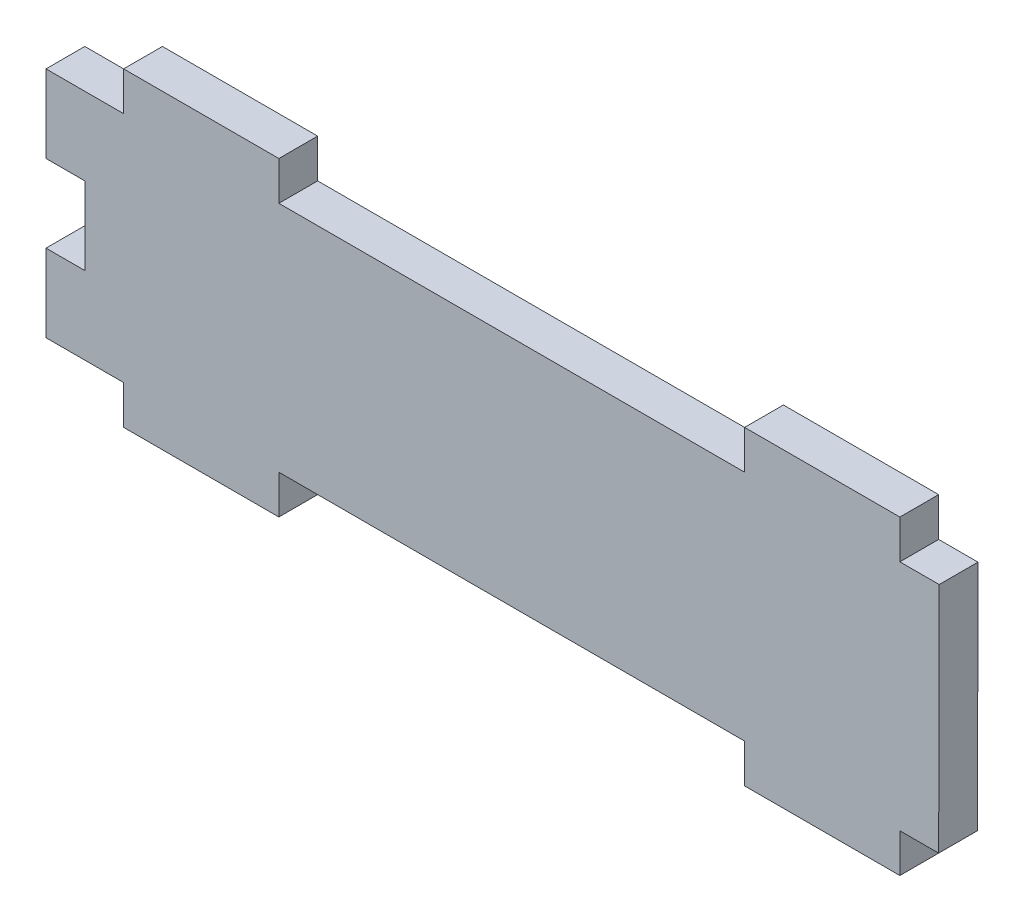
ISO-10303-21;
HEADER;
FILE_DESCRIPTION(('STEP AP214'),'2;1');
FILE_NAME('part.step','',(''),(''),'','','');
FILE_SCHEMA(('AUTOMOTIVE_DESIGN { 1 0 10303 214 1 1 1 1 }'));
ENDSEC;
DATA;
#1=APPLICATION_CONTEXT('core data for automotive mechanical design processes');
#2=APPLICATION_PROTOCOL_DEFINITION('international standard','automotive_design',2000,#1);
#3=PRODUCT_CONTEXT('',#1,'mechanical');
#4=PRODUCT('Part','Part','',(#3));
#5=PRODUCT_RELATED_PRODUCT_CATEGORY('part','',(#4));
#6=PRODUCT_DEFINITION_FORMATION('','',#4);
#7=PRODUCT_DEFINITION_CONTEXT('part definition',#1,'design');
#8=PRODUCT_DEFINITION('design','',#6,#7);
#9=PRODUCT_DEFINITION_SHAPE('','',#8);
#10=(LENGTH_UNIT() NAMED_UNIT(*) SI_UNIT(.MILLI.,.METRE.));
#11=(NAMED_UNIT(*) PLANE_ANGLE_UNIT() SI_UNIT($,.RADIAN.));
#12=(NAMED_UNIT(*) SI_UNIT($,.STERADIAN.) SOLID_ANGLE_UNIT());
#13=UNCERTAINTY_MEASURE_WITH_UNIT(LENGTH_MEASURE(1.E-05),#10,'distance_accuracy_value','');
#14=(GEOMETRIC_REPRESENTATION_CONTEXT(3) GLOBAL_UNCERTAINTY_ASSIGNED_CONTEXT((#13)) GLOBAL_UNIT_ASSIGNED_CONTEXT((#10,
#11,#12)) REPRESENTATION_CONTEXT('',''));
#15=CARTESIAN_POINT('',(0.,0.,0.));
#16=DIRECTION('',(0.,0.,1.));
#17=DIRECTION('',(1.,0.,0.));
#18=AXIS2_PLACEMENT_3D('',#15,#16,#17);
#19=CARTESIAN_POINT('',(146.134732735807,44.4499057789318,6.35));
#20=DIRECTION('',(-0.999997527006085,0.00222395632040106,0.));
#21=DIRECTION('',(-0.00222395632040106,-0.999997527006085,0.));
#22=AXIS2_PLACEMENT_3D('',#19,#20,#21);
#23=PLANE('',#22);
#24=DIRECTION('',(0.00222395632040106,0.999997527006085,0.));
#25=VECTOR('',#24,1.);
#26=CARTESIAN_POINT('',(146.134732735807,44.4499057789318,0.));
#27=LINE('',#26,#25);
#28=CARTESIAN_POINT('',(146.05,6.35,0.));
#29=VERTEX_POINT('',#28);
#30=CARTESIAN_POINT('',(146.134732735807,44.4499057789318,0.));
#31=VERTEX_POINT('',#30);
#32=EDGE_CURVE('E225',#29,#31,#27,.T.);
#33=ORIENTED_EDGE('',*,*,#32,.T.);
#34=DIRECTION('',(0.,0.,-1.));
#35=VECTOR('',#34,1.);
#36=CARTESIAN_POINT('',(146.134732735807,44.4499057789318,6.35));
#37=LINE('',#36,#35);
#38=CARTESIAN_POINT('',(146.134732735807,44.4499057789318,6.35));
#39=VERTEX_POINT('',#38);
#40=EDGE_CURVE('E11',#39,#31,#37,.T.);
#41=ORIENTED_EDGE('',*,*,#40,.F.);
#42=DIRECTION('',(0.00222395632040106,0.999997527006085,0.));
#43=VECTOR('',#42,1.);
#44=CARTESIAN_POINT('',(146.134732735807,44.4499057789318,6.35));
#45=LINE('',#44,#43);
#46=CARTESIAN_POINT('',(146.05,6.35,6.35));
#47=VERTEX_POINT('',#46);
#48=EDGE_CURVE('E273',#47,#39,#45,.T.);
#49=ORIENTED_EDGE('',*,*,#48,.F.);
#50=DIRECTION('',(0.,0.,-1.));
#51=VECTOR('',#50,1.);
#52=CARTESIAN_POINT('',(146.05,6.35,6.35));
#53=LINE('',#52,#51);
#54=EDGE_CURVE('E221',#47,#29,#53,.T.);
#55=ORIENTED_EDGE('',*,*,#54,.T.);
#56=EDGE_LOOP('',(#33,#41,#49,#55));
#57=FACE_BOUND('',#56,.T.);
#58=ADVANCED_FACE('F33',(#57),#23,.F.);
#59=CARTESIAN_POINT('',(139.70050083304,44.4499057789318,6.35));
#60=DIRECTION('',(0.,-1.,0.));
#61=DIRECTION('',(0.,0.,-1.));
#62=AXIS2_PLACEMENT_3D('',#59,#60,#61);
#63=PLANE('',#62);
#64=DIRECTION('',(-1.,0.,0.));
#65=VECTOR('',#64,1.);
#66=CARTESIAN_POINT('',(139.70050083304,44.4499057789318,0.));
#67=LINE('',#66,#65);
#68=CARTESIAN_POINT('',(139.70050083304,44.4499057789318,0.));
#69=VERTEX_POINT('',#68);
#70=EDGE_CURVE('E228',#31,#69,#67,.T.);
#71=ORIENTED_EDGE('',*,*,#70,.T.);
#72=DIRECTION('',(0.,0.,-1.));
#73=VECTOR('',#72,1.);
#74=CARTESIAN_POINT('',(139.70050083304,44.4499057789318,6.35));
#75=LINE('',#74,#73);
#76=CARTESIAN_POINT('',(139.70050083304,44.4499057789318,6.35));
#77=VERTEX_POINT('',#76);
#78=EDGE_CURVE('E41',#77,#69,#75,.T.);
#79=ORIENTED_EDGE('',*,*,#78,.F.);
#80=DIRECTION('',(-1.,0.,0.));
#81=VECTOR('',#80,1.);
#82=CARTESIAN_POINT('',(139.70050083304,44.4499057789318,6.35));
#83=LINE('',#82,#81);
#84=EDGE_CURVE('E140',#39,#77,#83,.T.);
#85=ORIENTED_EDGE('',*,*,#84,.F.);
#86=ORIENTED_EDGE('',*,*,#40,.T.);
#87=EDGE_LOOP('',(#71,#79,#85,#86));
#88=FACE_BOUND('',#87,.T.);
#89=ADVANCED_FACE('F411',(#88),#63,.F.);
#90=CARTESIAN_POINT('',(139.70050083304,44.4499057789318,6.35));
#91=DIRECTION('',(-1.,0.,0.));
#92=DIRECTION('',(0.,0.,1.));
#93=AXIS2_PLACEMENT_3D('',#90,#91,#92);
#94=PLANE('',#93);
#95=DIRECTION('',(0.,1.,0.));
#96=VECTOR('',#95,1.);
#97=CARTESIAN_POINT('',(139.70050083304,44.4499057789318,0.));
#98=LINE('',#97,#96);
#99=CARTESIAN_POINT('',(139.70050083304,50.8,0.));
#100=VERTEX_POINT('',#99);
#101=EDGE_CURVE('E230',#69,#100,#98,.T.);
#102=ORIENTED_EDGE('',*,*,#101,.T.);
#103=DIRECTION('',(0.,0.,-1.));
#104=VECTOR('',#103,1.);
#105=CARTESIAN_POINT('',(139.70050083304,50.8,6.35));
#106=LINE('',#105,#104);
#107=CARTESIAN_POINT('',(139.70050083304,50.8,6.35));
#108=VERTEX_POINT('',#107);
#109=EDGE_CURVE('E328',#108,#100,#106,.T.);
#110=ORIENTED_EDGE('',*,*,#109,.F.);
#111=DIRECTION('',(0.,1.,0.));
#112=VECTOR('',#111,1.);
#113=CARTESIAN_POINT('',(139.70050083304,44.4499057789318,6.35));
#114=LINE('',#113,#112);
#115=EDGE_CURVE('E336',#77,#108,#114,.T.);
#116=ORIENTED_EDGE('',*,*,#115,.F.);
#117=ORIENTED_EDGE('',*,*,#78,.T.);
#118=EDGE_LOOP('',(#102,#110,#116,#117));
#119=FACE_BOUND('',#118,.T.);
#120=ADVANCED_FACE('F334',(#119),#94,.F.);
#121=CARTESIAN_POINT('',(114.3,50.8,6.35));
#122=DIRECTION('',(0.,-1.,0.));
#123=DIRECTION('',(0.,0.,-1.));
#124=AXIS2_PLACEMENT_3D('',#121,#122,#123);
#125=PLANE('',#124);
#126=DIRECTION('',(-1.,0.,0.));
#127=VECTOR('',#126,1.);
#128=CARTESIAN_POINT('',(114.3,50.8,0.));
#129=LINE('',#128,#127);
#130=CARTESIAN_POINT('',(114.3,50.8,0.));
#131=VERTEX_POINT('',#130);
#132=EDGE_CURVE('E232',#100,#131,#129,.T.);
#133=ORIENTED_EDGE('',*,*,#132,.T.);
#134=DIRECTION('',(0.,0.,-1.));
#135=VECTOR('',#134,1.);
#136=CARTESIAN_POINT('',(114.3,50.8,6.35));
#137=LINE('',#136,#135);
#138=CARTESIAN_POINT('',(114.3,50.8,6.35));
#139=VERTEX_POINT('',#138);
#140=EDGE_CURVE('E325',#139,#131,#137,.T.);
#141=ORIENTED_EDGE('',*,*,#140,.F.);
#142=DIRECTION('',(-1.,0.,0.));
#143=VECTOR('',#142,1.);
#144=CARTESIAN_POINT('',(114.3,50.8,6.35));
#145=LINE('',#144,#143);
#146=EDGE_CURVE('E354',#108,#139,#145,.T.);
#147=ORIENTED_EDGE('',*,*,#146,.F.);
#148=ORIENTED_EDGE('',*,*,#109,.T.);
#149=EDGE_LOOP('',(#133,#141,#147,#148));
#150=FACE_BOUND('',#149,.T.);
#151=ADVANCED_FACE('F345',(#150),#125,.F.);
#152=CARTESIAN_POINT('',(114.3,44.45,6.35));
#153=DIRECTION('',(1.,0.,0.));
#154=DIRECTION('',(0.,0.,-1.));
#155=AXIS2_PLACEMENT_3D('',#152,#153,#154);
#156=PLANE('',#155);
#157=DIRECTION('',(0.,-1.,0.));
#158=VECTOR('',#157,1.);
#159=CARTESIAN_POINT('',(114.3,44.45,0.));
#160=LINE('',#159,#158);
#161=CARTESIAN_POINT('',(114.3,44.45,0.));
#162=VERTEX_POINT('',#161);
#163=EDGE_CURVE('E234',#131,#162,#160,.T.);
#164=ORIENTED_EDGE('',*,*,#163,.T.);
#165=DIRECTION('',(0.,0.,-1.));
#166=VECTOR('',#165,1.);
#167=CARTESIAN_POINT('',(114.3,44.45,6.35));
#168=LINE('',#167,#166);
#169=CARTESIAN_POINT('',(114.3,44.45,6.35));
#170=VERTEX_POINT('',#169);
#171=EDGE_CURVE('E322',#170,#162,#168,.T.);
#172=ORIENTED_EDGE('',*,*,#171,.F.);
#173=DIRECTION('',(0.,-1.,0.));
#174=VECTOR('',#173,1.);
#175=CARTESIAN_POINT('',(114.3,44.45,6.35));
#176=LINE('',#175,#174);
#177=EDGE_CURVE('E351',#139,#170,#176,.T.);
#178=ORIENTED_EDGE('',*,*,#177,.F.);
#179=ORIENTED_EDGE('',*,*,#140,.T.);
#180=EDGE_LOOP('',(#164,#172,#178,#179));
#181=FACE_BOUND('',#180,.T.);
#182=ADVANCED_FACE('F349',(#181),#156,.F.);
#183=CARTESIAN_POINT('',(38.1,44.45,6.35));
#184=DIRECTION('',(0.,-1.,0.));
#185=DIRECTION('',(0.,0.,-1.));
#186=AXIS2_PLACEMENT_3D('',#183,#184,#185);
#187=PLANE('',#186);
#188=DIRECTION('',(-1.,0.,0.));
#189=VECTOR('',#188,1.);
#190=CARTESIAN_POINT('',(38.1,44.45,0.));
#191=LINE('',#190,#189);
#192=CARTESIAN_POINT('',(38.1,44.45,0.));
#193=VERTEX_POINT('',#192);
#194=EDGE_CURVE('E236',#162,#193,#191,.T.);
#195=ORIENTED_EDGE('',*,*,#194,.T.);
#196=DIRECTION('',(0.,0.,-1.));
#197=VECTOR('',#196,1.);
#198=CARTESIAN_POINT('',(38.1,44.45,6.35));
#199=LINE('',#198,#197);
#200=CARTESIAN_POINT('',(38.1,44.45,6.35));
#201=VERTEX_POINT('',#200);
#202=EDGE_CURVE('E319',#201,#193,#199,.T.);
#203=ORIENTED_EDGE('',*,*,#202,.F.);
#204=DIRECTION('',(-1.,0.,0.));
#205=VECTOR('',#204,1.);
#206=CARTESIAN_POINT('',(38.1,44.45,6.35));
#207=LINE('',#206,#205);
#208=EDGE_CURVE('E353',#170,#201,#207,.T.);
#209=ORIENTED_EDGE('',*,*,#208,.F.);
#210=ORIENTED_EDGE('',*,*,#171,.T.);
#211=EDGE_LOOP('',(#195,#203,#209,#210));
#212=FACE_BOUND('',#211,.T.);
#213=ADVANCED_FACE('F424',(#212),#187,.F.);
#214=CARTESIAN_POINT('',(38.1,44.45,6.35));
#215=DIRECTION('',(-1.,0.,0.));
#216=DIRECTION('',(0.,0.,1.));
#217=AXIS2_PLACEMENT_3D('',#214,#215,#216);
#218=PLANE('',#217);
#219=DIRECTION('',(0.,1.,0.));
#220=VECTOR('',#219,1.);
#221=CARTESIAN_POINT('',(38.1,44.45,0.));
#222=LINE('',#221,#220);
#223=CARTESIAN_POINT('',(38.1,50.8,0.));
#224=VERTEX_POINT('',#223);
#225=EDGE_CURVE('E238',#193,#224,#222,.T.);
#226=ORIENTED_EDGE('',*,*,#225,.T.);
#227=DIRECTION('',(0.,0.,-1.));
#228=VECTOR('',#227,1.);
#229=CARTESIAN_POINT('',(38.1,50.8,6.35));
#230=LINE('',#229,#228);
#231=CARTESIAN_POINT('',(38.1,50.8,6.35));
#232=VERTEX_POINT('',#231);
#233=EDGE_CURVE('E316',#232,#224,#230,.T.);
#234=ORIENTED_EDGE('',*,*,#233,.F.);
#235=DIRECTION('',(0.,1.,0.));
#236=VECTOR('',#235,1.);
#237=CARTESIAN_POINT('',(38.1,44.45,6.35));
#238=LINE('',#237,#236);
#239=EDGE_CURVE('E356',#201,#232,#238,.T.);
#240=ORIENTED_EDGE('',*,*,#239,.F.);
#241=ORIENTED_EDGE('',*,*,#202,.T.);
#242=EDGE_LOOP('',(#226,#234,#240,#241));
#243=FACE_BOUND('',#242,.T.);
#244=ADVANCED_FACE('F427',(#243),#218,.F.);
#245=CARTESIAN_POINT('',(12.7,50.8,6.35));
#246=DIRECTION('',(0.,-1.,0.));
#247=DIRECTION('',(0.,0.,-1.));
#248=AXIS2_PLACEMENT_3D('',#245,#246,#247);
#249=PLANE('',#248);
#250=DIRECTION('',(-1.,0.,0.));
#251=VECTOR('',#250,1.);
#252=CARTESIAN_POINT('',(12.7,50.8,0.));
#253=LINE('',#252,#251);
#254=CARTESIAN_POINT('',(12.7,50.8,0.));
#255=VERTEX_POINT('',#254);
#256=EDGE_CURVE('E240',#224,#255,#253,.T.);
#257=ORIENTED_EDGE('',*,*,#256,.T.);
#258=DIRECTION('',(0.,0.,-1.));
#259=VECTOR('',#258,1.);
#260=CARTESIAN_POINT('',(12.7,50.8,6.35));
#261=LINE('',#260,#259);
#262=CARTESIAN_POINT('',(12.7,50.8,6.35));
#263=VERTEX_POINT('',#262);
#264=EDGE_CURVE('E313',#263,#255,#261,.T.);
#265=ORIENTED_EDGE('',*,*,#264,.F.);
#266=DIRECTION('',(-1.,0.,0.));
#267=VECTOR('',#266,1.);
#268=CARTESIAN_POINT('',(12.7,50.8,6.35));
#269=LINE('',#268,#267);
#270=EDGE_CURVE('E362',#232,#263,#269,.T.);
#271=ORIENTED_EDGE('',*,*,#270,.F.);
#272=ORIENTED_EDGE('',*,*,#233,.T.);
#273=EDGE_LOOP('',(#257,#265,#271,#272));
#274=FACE_BOUND('',#273,.T.);
#275=ADVANCED_FACE('F431',(#274),#249,.F.);
#276=CARTESIAN_POINT('',(12.7,44.45,6.35));
#277=DIRECTION('',(1.,0.,0.));
#278=DIRECTION('',(0.,0.,-1.));
#279=AXIS2_PLACEMENT_3D('',#276,#277,#278);
#280=PLANE('',#279);
#281=DIRECTION('',(0.,-1.,0.));
#282=VECTOR('',#281,1.);
#283=CARTESIAN_POINT('',(12.7,44.45,0.));
#284=LINE('',#283,#282);
#285=CARTESIAN_POINT('',(12.7,44.45,0.));
#286=VERTEX_POINT('',#285);
#287=EDGE_CURVE('E242',#255,#286,#284,.T.);
#288=ORIENTED_EDGE('',*,*,#287,.T.);
#289=DIRECTION('',(0.,0.,-1.));
#290=VECTOR('',#289,1.);
#291=CARTESIAN_POINT('',(12.7,44.45,6.35));
#292=LINE('',#291,#290);
#293=CARTESIAN_POINT('',(12.7,44.45,6.35));
#294=VERTEX_POINT('',#293);
#295=EDGE_CURVE('E310',#294,#286,#292,.T.);
#296=ORIENTED_EDGE('',*,*,#295,.F.);
#297=DIRECTION('',(0.,-1.,0.));
#298=VECTOR('',#297,1.);
#299=CARTESIAN_POINT('',(12.7,44.45,6.35));
#300=LINE('',#299,#298);
#301=EDGE_CURVE('E364',#263,#294,#300,.T.);
#302=ORIENTED_EDGE('',*,*,#301,.F.);
#303=ORIENTED_EDGE('',*,*,#264,.T.);
#304=EDGE_LOOP('',(#288,#296,#302,#303));
#305=FACE_BOUND('',#304,.T.);
#306=ADVANCED_FACE('F435',(#305),#280,.F.);
#307=CARTESIAN_POINT('',(0.,44.45,6.35));
#308=DIRECTION('',(0.,-1.,0.));
#309=DIRECTION('',(0.,0.,-1.));
#310=AXIS2_PLACEMENT_3D('',#307,#308,#309);
#311=PLANE('',#310);
#312=DIRECTION('',(-1.,0.,0.));
#313=VECTOR('',#312,1.);
#314=CARTESIAN_POINT('',(0.,44.45,0.));
#315=LINE('',#314,#313);
#316=CARTESIAN_POINT('',(0.,44.45,0.));
#317=VERTEX_POINT('',#316);
#318=EDGE_CURVE('E245',#286,#317,#315,.T.);
#319=ORIENTED_EDGE('',*,*,#318,.T.);
#320=DIRECTION('',(0.,0.,-1.));
#321=VECTOR('',#320,1.);
#322=CARTESIAN_POINT('',(0.,44.45,6.35));
#323=LINE('',#322,#321);
#324=CARTESIAN_POINT('',(0.,44.45,6.35));
#325=VERTEX_POINT('',#324);
#326=EDGE_CURVE('E307',#325,#317,#323,.T.);
#327=ORIENTED_EDGE('',*,*,#326,.F.);
#328=DIRECTION('',(-1.,0.,0.));
#329=VECTOR('',#328,1.);
#330=CARTESIAN_POINT('',(6.35,44.45,6.35));
#331=LINE('',#330,#329);
#332=EDGE_CURVE('E366',#294,#325,#331,.T.);
#333=ORIENTED_EDGE('',*,*,#332,.F.);
#334=ORIENTED_EDGE('',*,*,#295,.T.);
#335=EDGE_LOOP('',(#319,#327,#333,#334));
#336=FACE_BOUND('',#335,.T.);
#337=ADVANCED_FACE('F439',(#336),#311,.F.);
#338=CARTESIAN_POINT('',(0.,44.45,6.35));
#339=DIRECTION('',(1.,0.,0.));
#340=DIRECTION('',(0.,0.,-1.));
#341=AXIS2_PLACEMENT_3D('',#338,#339,#340);
#342=PLANE('',#341);
#343=DIRECTION('',(0.,-1.,0.));
#344=VECTOR('',#343,1.);
#345=CARTESIAN_POINT('',(0.,44.45,0.));
#346=LINE('',#345,#344);
#347=CARTESIAN_POINT('',(0.,31.75,0.));
#348=VERTEX_POINT('',#347);
#349=EDGE_CURVE('E247',#317,#348,#346,.T.);
#350=ORIENTED_EDGE('',*,*,#349,.T.);
#351=DIRECTION('',(0.,0.,-1.));
#352=VECTOR('',#351,1.);
#353=CARTESIAN_POINT('',(0.,31.75,6.35));
#354=LINE('',#353,#352);
#355=CARTESIAN_POINT('',(0.,31.75,6.35));
#356=VERTEX_POINT('',#355);
#357=EDGE_CURVE('E304',#356,#348,#354,.T.);
#358=ORIENTED_EDGE('',*,*,#357,.F.);
#359=DIRECTION('',(0.,-1.,0.));
#360=VECTOR('',#359,1.);
#361=CARTESIAN_POINT('',(0.,44.45,6.35));
#362=LINE('',#361,#360);
#363=EDGE_CURVE('E368',#325,#356,#362,.T.);
#364=ORIENTED_EDGE('',*,*,#363,.F.);
#365=ORIENTED_EDGE('',*,*,#326,.T.);
#366=EDGE_LOOP('',(#350,#358,#364,#365));
#367=FACE_BOUND('',#366,.T.);
#368=ADVANCED_FACE('F443',(#367),#342,.F.);
#369=CARTESIAN_POINT('',(0.,31.75,6.35));
#370=DIRECTION('',(0.,1.,0.));
#371=DIRECTION('',(0.,0.,1.));
#372=AXIS2_PLACEMENT_3D('',#369,#370,#371);
#373=PLANE('',#372);
#374=DIRECTION('',(1.,0.,0.));
#375=VECTOR('',#374,1.);
#376=CARTESIAN_POINT('',(0.,31.75,0.));
#377=LINE('',#376,#375);
#378=CARTESIAN_POINT('',(6.35,31.75,0.));
#379=VERTEX_POINT('',#378);
#380=EDGE_CURVE('E249',#348,#379,#377,.T.);
#381=ORIENTED_EDGE('',*,*,#380,.T.);
#382=DIRECTION('',(0.,0.,-1.));
#383=VECTOR('',#382,1.);
#384=CARTESIAN_POINT('',(6.35,31.75,6.35));
#385=LINE('',#384,#383);
#386=CARTESIAN_POINT('',(6.35,31.75,6.35));
#387=VERTEX_POINT('',#386);
#388=EDGE_CURVE('E301',#387,#379,#385,.T.);
#389=ORIENTED_EDGE('',*,*,#388,.F.);
#390=DIRECTION('',(1.,0.,0.));
#391=VECTOR('',#390,1.);
#392=CARTESIAN_POINT('',(0.,31.75,6.35));
#393=LINE('',#392,#391);
#394=EDGE_CURVE('E370',#356,#387,#393,.T.);
#395=ORIENTED_EDGE('',*,*,#394,.F.);
#396=ORIENTED_EDGE('',*,*,#357,.T.);
#397=EDGE_LOOP('',(#381,#389,#395,#396));
#398=FACE_BOUND('',#397,.T.);
#399=ADVANCED_FACE('F447',(#398),#373,.F.);
#400=CARTESIAN_POINT('',(6.35,31.75,6.35));
#401=DIRECTION('',(1.,0.,0.));
#402=DIRECTION('',(0.,0.,-1.));
#403=AXIS2_PLACEMENT_3D('',#400,#401,#402);
#404=PLANE('',#403);
#405=DIRECTION('',(0.,-1.,0.));
#406=VECTOR('',#405,1.);
#407=CARTESIAN_POINT('',(6.35,31.75,0.));
#408=LINE('',#407,#406);
#409=CARTESIAN_POINT('',(6.35,19.05,0.));
#410=VERTEX_POINT('',#409);
#411=EDGE_CURVE('E251',#379,#410,#408,.T.);
#412=ORIENTED_EDGE('',*,*,#411,.T.);
#413=DIRECTION('',(0.,0.,-1.));
#414=VECTOR('',#413,1.);
#415=CARTESIAN_POINT('',(6.35,19.05,6.35));
#416=LINE('',#415,#414);
#417=CARTESIAN_POINT('',(6.35,19.05,6.35));
#418=VERTEX_POINT('',#417);
#419=EDGE_CURVE('E298',#418,#410,#416,.T.);
#420=ORIENTED_EDGE('',*,*,#419,.F.);
#421=DIRECTION('',(0.,-1.,0.));
#422=VECTOR('',#421,1.);
#423=CARTESIAN_POINT('',(6.35,31.75,6.35));
#424=LINE('',#423,#422);
#425=EDGE_CURVE('E372',#387,#418,#424,.T.);
#426=ORIENTED_EDGE('',*,*,#425,.F.);
#427=ORIENTED_EDGE('',*,*,#388,.T.);
#428=EDGE_LOOP('',(#412,#420,#426,#427));
#429=FACE_BOUND('',#428,.T.);
#430=ADVANCED_FACE('F451',(#429),#404,.F.);
#431=CARTESIAN_POINT('',(0.,19.05,6.35));
#432=DIRECTION('',(0.,-1.,0.));
#433=DIRECTION('',(0.,0.,-1.));
#434=AXIS2_PLACEMENT_3D('',#431,#432,#433);
#435=PLANE('',#434);
#436=DIRECTION('',(-1.,0.,0.));
#437=VECTOR('',#436,1.);
#438=CARTESIAN_POINT('',(0.,19.05,0.));
#439=LINE('',#438,#437);
#440=CARTESIAN_POINT('',(0.,19.05,0.));
#441=VERTEX_POINT('',#440);
#442=EDGE_CURVE('E253',#410,#441,#439,.T.);
#443=ORIENTED_EDGE('',*,*,#442,.T.);
#444=DIRECTION('',(0.,0.,-1.));
#445=VECTOR('',#444,1.);
#446=CARTESIAN_POINT('',(0.,19.05,6.35));
#447=LINE('',#446,#445);
#448=CARTESIAN_POINT('',(0.,19.05,6.35));
#449=VERTEX_POINT('',#448);
#450=EDGE_CURVE('E295',#449,#441,#447,.T.);
#451=ORIENTED_EDGE('',*,*,#450,.F.);
#452=DIRECTION('',(-1.,0.,0.));
#453=VECTOR('',#452,1.);
#454=CARTESIAN_POINT('',(0.,19.05,6.35));
#455=LINE('',#454,#453);
#456=EDGE_CURVE('E374',#418,#449,#455,.T.);
#457=ORIENTED_EDGE('',*,*,#456,.F.);
#458=ORIENTED_EDGE('',*,*,#419,.T.);
#459=EDGE_LOOP('',(#443,#451,#457,#458));
#460=FACE_BOUND('',#459,.T.);
#461=ADVANCED_FACE('F455',(#460),#435,.F.);
#462=CARTESIAN_POINT('',(0.,19.05,6.35));
#463=DIRECTION('',(1.,0.,0.));
#464=DIRECTION('',(0.,0.,-1.));
#465=AXIS2_PLACEMENT_3D('',#462,#463,#464);
#466=PLANE('',#465);
#467=DIRECTION('',(0.,-1.,0.));
#468=VECTOR('',#467,1.);
#469=CARTESIAN_POINT('',(0.,19.05,0.));
#470=LINE('',#469,#468);
#471=CARTESIAN_POINT('',(0.,6.35,0.));
#472=VERTEX_POINT('',#471);
#473=EDGE_CURVE('E255',#441,#472,#470,.T.);
#474=ORIENTED_EDGE('',*,*,#473,.T.);
#475=DIRECTION('',(0.,0.,-1.));
#476=VECTOR('',#475,1.);
#477=CARTESIAN_POINT('',(0.,6.35,6.35));
#478=LINE('',#477,#476);
#479=CARTESIAN_POINT('',(0.,6.35,6.35));
#480=VERTEX_POINT('',#479);
#481=EDGE_CURVE('E292',#480,#472,#478,.T.);
#482=ORIENTED_EDGE('',*,*,#481,.F.);
#483=DIRECTION('',(0.,-1.,0.));
#484=VECTOR('',#483,1.);
#485=CARTESIAN_POINT('',(0.,19.05,6.35));
#486=LINE('',#485,#484);
#487=EDGE_CURVE('E376',#449,#480,#486,.T.);
#488=ORIENTED_EDGE('',*,*,#487,.F.);
#489=ORIENTED_EDGE('',*,*,#450,.T.);
#490=EDGE_LOOP('',(#474,#482,#488,#489));
#491=FACE_BOUND('',#490,.T.);
#492=ADVANCED_FACE('F459',(#491),#466,.F.);
#493=CARTESIAN_POINT('',(6.35,6.35,6.35));
#494=DIRECTION('',(0.,1.,0.));
#495=DIRECTION('',(0.,0.,1.));
#496=AXIS2_PLACEMENT_3D('',#493,#494,#495);
#497=PLANE('',#496);
#498=DIRECTION('',(1.,0.,0.));
#499=VECTOR('',#498,1.);
#500=CARTESIAN_POINT('',(6.35,6.35,0.));
#501=LINE('',#500,#499);
#502=CARTESIAN_POINT('',(12.7,6.35,0.));
#503=VERTEX_POINT('',#502);
#504=EDGE_CURVE('E258',#472,#503,#501,.T.);
#505=ORIENTED_EDGE('',*,*,#504,.T.);
#506=DIRECTION('',(0.,0.,-1.));
#507=VECTOR('',#506,1.);
#508=CARTESIAN_POINT('',(12.7,6.35,6.35));
#509=LINE('',#508,#507);
#510=CARTESIAN_POINT('',(12.7,6.35,6.35));
#511=VERTEX_POINT('',#510);
#512=EDGE_CURVE('E289',#511,#503,#509,.T.);
#513=ORIENTED_EDGE('',*,*,#512,.F.);
#514=DIRECTION('',(1.,0.,0.));
#515=VECTOR('',#514,1.);
#516=CARTESIAN_POINT('',(0.,6.35,6.35));
#517=LINE('',#516,#515);
#518=EDGE_CURVE('E378',#480,#511,#517,.T.);
#519=ORIENTED_EDGE('',*,*,#518,.F.);
#520=ORIENTED_EDGE('',*,*,#481,.T.);
#521=EDGE_LOOP('',(#505,#513,#519,#520));
#522=FACE_BOUND('',#521,.T.);
#523=ADVANCED_FACE('F463',(#522),#497,.F.);
#524=CARTESIAN_POINT('',(12.7,6.35,6.35));
#525=DIRECTION('',(1.,0.,0.));
#526=DIRECTION('',(0.,1.,0.));
#527=AXIS2_PLACEMENT_3D('',#524,#525,#526);
#528=PLANE('',#527);
#529=DIRECTION('',(0.,-1.,0.));
#530=VECTOR('',#529,1.);
#531=CARTESIAN_POINT('',(12.7,6.35,0.));
#532=LINE('',#531,#530);
#533=CARTESIAN_POINT('',(12.7,0.,0.));
#534=VERTEX_POINT('',#533);
#535=EDGE_CURVE('E260',#503,#534,#532,.T.);
#536=ORIENTED_EDGE('',*,*,#535,.T.);
#537=DIRECTION('',(0.,0.,-1.));
#538=VECTOR('',#537,1.);
#539=CARTESIAN_POINT('',(12.7,0.,6.35));
#540=LINE('',#539,#538);
#541=CARTESIAN_POINT('',(12.7,0.,6.35));
#542=VERTEX_POINT('',#541);
#543=EDGE_CURVE('E286',#542,#534,#540,.T.);
#544=ORIENTED_EDGE('',*,*,#543,.F.);
#545=DIRECTION('',(0.,-1.,0.));
#546=VECTOR('',#545,1.);
#547=CARTESIAN_POINT('',(12.7,6.35,6.35));
#548=LINE('',#547,#546);
#549=EDGE_CURVE('E380',#511,#542,#548,.T.);
#550=ORIENTED_EDGE('',*,*,#549,.F.);
#551=ORIENTED_EDGE('',*,*,#512,.T.);
#552=EDGE_LOOP('',(#536,#544,#550,#551));
#553=FACE_BOUND('',#552,.T.);
#554=ADVANCED_FACE('F467',(#553),#528,.F.);
#555=CARTESIAN_POINT('',(12.7,0.,6.35));
#556=DIRECTION('',(0.,1.,0.));
#557=DIRECTION('',(-1.,0.,0.));
#558=AXIS2_PLACEMENT_3D('',#555,#556,#557);
#559=PLANE('',#558);
#560=DIRECTION('',(1.,0.,0.));
#561=VECTOR('',#560,1.);
#562=CARTESIAN_POINT('',(12.7,0.,0.));
#563=LINE('',#562,#561);
#564=CARTESIAN_POINT('',(38.1,0.,0.));
#565=VERTEX_POINT('',#564);
#566=EDGE_CURVE('E262',#534,#565,#563,.T.);
#567=ORIENTED_EDGE('',*,*,#566,.T.);
#568=DIRECTION('',(0.,0.,-1.));
#569=VECTOR('',#568,1.);
#570=CARTESIAN_POINT('',(38.1,0.,6.35));
#571=LINE('',#570,#569);
#572=CARTESIAN_POINT('',(38.1,0.,6.35));
#573=VERTEX_POINT('',#572);
#574=EDGE_CURVE('E283',#573,#565,#571,.T.);
#575=ORIENTED_EDGE('',*,*,#574,.F.);
#576=DIRECTION('',(1.,0.,0.));
#577=VECTOR('',#576,1.);
#578=CARTESIAN_POINT('',(12.7,0.,6.35));
#579=LINE('',#578,#577);
#580=EDGE_CURVE('E382',#542,#573,#579,.T.);
#581=ORIENTED_EDGE('',*,*,#580,.F.);
#582=ORIENTED_EDGE('',*,*,#543,.T.);
#583=EDGE_LOOP('',(#567,#575,#581,#582));
#584=FACE_BOUND('',#583,.T.);
#585=ADVANCED_FACE('F471',(#584),#559,.F.);
#586=CARTESIAN_POINT('',(38.1,6.35,6.35));
#587=DIRECTION('',(-1.,0.,0.));
#588=DIRECTION('',(0.,-1.,0.));
#589=AXIS2_PLACEMENT_3D('',#586,#587,#588);
#590=PLANE('',#589);
#591=DIRECTION('',(0.,1.,0.));
#592=VECTOR('',#591,1.);
#593=CARTESIAN_POINT('',(38.1,6.35,0.));
#594=LINE('',#593,#592);
#595=CARTESIAN_POINT('',(38.1,6.35,0.));
#596=VERTEX_POINT('',#595);
#597=EDGE_CURVE('E264',#565,#596,#594,.T.);
#598=ORIENTED_EDGE('',*,*,#597,.T.);
#599=DIRECTION('',(0.,0.,-1.));
#600=VECTOR('',#599,1.);
#601=CARTESIAN_POINT('',(38.1,6.35,6.35));
#602=LINE('',#601,#600);
#603=CARTESIAN_POINT('',(38.1,6.35,6.35));
#604=VERTEX_POINT('',#603);
#605=EDGE_CURVE('E280',#604,#596,#602,.T.);
#606=ORIENTED_EDGE('',*,*,#605,.F.);
#607=DIRECTION('',(0.,1.,0.));
#608=VECTOR('',#607,1.);
#609=CARTESIAN_POINT('',(38.1,6.35,6.35));
#610=LINE('',#609,#608);
#611=EDGE_CURVE('E384',#573,#604,#610,.T.);
#612=ORIENTED_EDGE('',*,*,#611,.F.);
#613=ORIENTED_EDGE('',*,*,#574,.T.);
#614=EDGE_LOOP('',(#598,#606,#612,#613));
#615=FACE_BOUND('',#614,.T.);
#616=ADVANCED_FACE('F475',(#615),#590,.F.);
#617=CARTESIAN_POINT('',(38.1,6.35,6.35));
#618=DIRECTION('',(0.,1.,0.));
#619=DIRECTION('',(0.,0.,1.));
#620=AXIS2_PLACEMENT_3D('',#617,#618,#619);
#621=PLANE('',#620);
#622=DIRECTION('',(1.,0.,0.));
#623=VECTOR('',#622,1.);
#624=CARTESIAN_POINT('',(38.1,6.35,0.));
#625=LINE('',#624,#623);
#626=CARTESIAN_POINT('',(114.3,6.35,0.));
#627=VERTEX_POINT('',#626);
#628=EDGE_CURVE('E266',#596,#627,#625,.T.);
#629=ORIENTED_EDGE('',*,*,#628,.T.);
#630=DIRECTION('',(0.,0.,-1.));
#631=VECTOR('',#630,1.);
#632=CARTESIAN_POINT('',(114.3,6.35,6.35));
#633=LINE('',#632,#631);
#634=CARTESIAN_POINT('',(114.3,6.35,6.35));
#635=VERTEX_POINT('',#634);
#636=EDGE_CURVE('E277',#635,#627,#633,.T.);
#637=ORIENTED_EDGE('',*,*,#636,.F.);
#638=DIRECTION('',(1.,0.,0.));
#639=VECTOR('',#638,1.);
#640=CARTESIAN_POINT('',(38.1,6.35,6.35));
#641=LINE('',#640,#639);
#642=EDGE_CURVE('E386',#604,#635,#641,.T.);
#643=ORIENTED_EDGE('',*,*,#642,.F.);
#644=ORIENTED_EDGE('',*,*,#605,.T.);
#645=EDGE_LOOP('',(#629,#637,#643,#644));
#646=FACE_BOUND('',#645,.T.);
#647=ADVANCED_FACE('F392',(#646),#621,.F.);
#648=CARTESIAN_POINT('',(114.3,6.35,6.35));
#649=DIRECTION('',(1.,0.,0.));
#650=DIRECTION('',(0.,1.,0.));
#651=AXIS2_PLACEMENT_3D('',#648,#649,#650);
#652=PLANE('',#651);
#653=DIRECTION('',(0.,-1.,0.));
#654=VECTOR('',#653,1.);
#655=CARTESIAN_POINT('',(114.3,6.35,0.));
#656=LINE('',#655,#654);
#657=CARTESIAN_POINT('',(114.3,0.,0.));
#658=VERTEX_POINT('',#657);
#659=EDGE_CURVE('E268',#627,#658,#656,.T.);
#660=ORIENTED_EDGE('',*,*,#659,.T.);
#661=DIRECTION('',(0.,0.,-1.));
#662=VECTOR('',#661,1.);
#663=CARTESIAN_POINT('',(114.3,0.,6.35));
#664=LINE('',#663,#662);
#665=CARTESIAN_POINT('',(114.3,0.,6.35));
#666=VERTEX_POINT('',#665);
#667=EDGE_CURVE('E216',#666,#658,#664,.T.);
#668=ORIENTED_EDGE('',*,*,#667,.F.);
#669=DIRECTION('',(0.,-1.,0.));
#670=VECTOR('',#669,1.);
#671=CARTESIAN_POINT('',(114.3,6.35,6.35));
#672=LINE('',#671,#670);
#673=EDGE_CURVE('E207',#635,#666,#672,.T.);
#674=ORIENTED_EDGE('',*,*,#673,.F.);
#675=ORIENTED_EDGE('',*,*,#636,.T.);
#676=EDGE_LOOP('',(#660,#668,#674,#675));
#677=FACE_BOUND('',#676,.T.);
#678=ADVANCED_FACE('F396',(#677),#652,.F.);
#679=CARTESIAN_POINT('',(114.3,0.,6.35));
#680=DIRECTION('',(0.,1.,0.));
#681=DIRECTION('',(-1.,0.,0.));
#682=AXIS2_PLACEMENT_3D('',#679,#680,#681);
#683=PLANE('',#682);
#684=DIRECTION('',(1.,0.,0.));
#685=VECTOR('',#684,1.);
#686=CARTESIAN_POINT('',(114.3,0.,0.));
#687=LINE('',#686,#685);
#688=CARTESIAN_POINT('',(139.7,0.,0.));
#689=VERTEX_POINT('',#688);
#690=EDGE_CURVE('E215',#658,#689,#687,.T.);
#691=ORIENTED_EDGE('',*,*,#690,.T.);
#692=DIRECTION('',(0.,0.,-1.));
#693=VECTOR('',#692,1.);
#694=CARTESIAN_POINT('',(139.7,0.,6.35));
#695=LINE('',#694,#693);
#696=CARTESIAN_POINT('',(139.7,0.,6.35));
#697=VERTEX_POINT('',#696);
#698=EDGE_CURVE('E212',#697,#689,#695,.T.);
#699=ORIENTED_EDGE('',*,*,#698,.F.);
#700=DIRECTION('',(1.,0.,0.));
#701=VECTOR('',#700,1.);
#702=CARTESIAN_POINT('',(114.3,0.,6.35));
#703=LINE('',#702,#701);
#704=EDGE_CURVE('E201',#666,#697,#703,.T.);
#705=ORIENTED_EDGE('',*,*,#704,.F.);
#706=ORIENTED_EDGE('',*,*,#667,.T.);
#707=EDGE_LOOP('',(#691,#699,#705,#706));
#708=FACE_BOUND('',#707,.T.);
#709=ADVANCED_FACE('F213',(#708),#683,.F.);
#710=CARTESIAN_POINT('',(139.7,6.35,6.35));
#711=DIRECTION('',(-1.,0.,0.));
#712=DIRECTION('',(0.,-1.,0.));
#713=AXIS2_PLACEMENT_3D('',#710,#711,#712);
#714=PLANE('',#713);
#715=DIRECTION('',(0.,1.,0.));
#716=VECTOR('',#715,1.);
#717=CARTESIAN_POINT('',(139.7,6.35,0.));
#718=LINE('',#717,#716);
#719=CARTESIAN_POINT('',(139.7,6.35,0.));
#720=VERTEX_POINT('',#719);
#721=EDGE_CURVE('E126',#689,#720,#718,.T.);
#722=ORIENTED_EDGE('',*,*,#721,.T.);
#723=DIRECTION('',(0.,0.,-1.));
#724=VECTOR('',#723,1.);
#725=CARTESIAN_POINT('',(139.7,6.35,6.35));
#726=LINE('',#725,#724);
#727=CARTESIAN_POINT('',(139.7,6.35,6.35));
#728=VERTEX_POINT('',#727);
#729=EDGE_CURVE('E217',#728,#720,#726,.T.);
#730=ORIENTED_EDGE('',*,*,#729,.F.);
#731=DIRECTION('',(0.,1.,0.));
#732=VECTOR('',#731,1.);
#733=CARTESIAN_POINT('',(139.7,6.35,6.35));
#734=LINE('',#733,#732);
#735=EDGE_CURVE('E205',#697,#728,#734,.T.);
#736=ORIENTED_EDGE('',*,*,#735,.F.);
#737=ORIENTED_EDGE('',*,*,#698,.T.);
#738=EDGE_LOOP('',(#722,#730,#736,#737));
#739=FACE_BOUND('',#738,.T.);
#740=ADVANCED_FACE('F219',(#739),#714,.F.);
#741=CARTESIAN_POINT('',(139.7,6.35,6.35));
#742=DIRECTION('',(0.,1.,0.));
#743=DIRECTION('',(0.,0.,1.));
#744=AXIS2_PLACEMENT_3D('',#741,#742,#743);
#745=PLANE('',#744);
#746=DIRECTION('',(1.,0.,0.));
#747=VECTOR('',#746,1.);
#748=CARTESIAN_POINT('',(139.7,6.35,0.));
#749=LINE('',#748,#747);
#750=EDGE_CURVE('E132',#720,#29,#749,.T.);
#751=ORIENTED_EDGE('',*,*,#750,.T.);
#752=ORIENTED_EDGE('',*,*,#54,.F.);
#753=DIRECTION('',(1.,0.,0.));
#754=VECTOR('',#753,1.);
#755=CARTESIAN_POINT('',(139.7,6.35,6.35));
#756=LINE('',#755,#754);
#757=EDGE_CURVE('E49',#728,#47,#756,.T.);
#758=ORIENTED_EDGE('',*,*,#757,.F.);
#759=ORIENTED_EDGE('',*,*,#729,.T.);
#760=EDGE_LOOP('',(#751,#752,#758,#759));
#761=FACE_BOUND('',#760,.T.);
#762=ADVANCED_FACE('F400',(#761),#745,.F.);
#763=CARTESIAN_POINT('',(0.,0.,6.35));
#764=DIRECTION('',(0.,0.,1.));
#765=DIRECTION('',(1.,0.,0.));
#766=AXIS2_PLACEMENT_3D('',#763,#764,#765);
#767=PLANE('',#766);
#768=ORIENTED_EDGE('',*,*,#48,.T.);
#769=ORIENTED_EDGE('',*,*,#84,.T.);
#770=ORIENTED_EDGE('',*,*,#115,.T.);
#771=ORIENTED_EDGE('',*,*,#146,.T.);
#772=ORIENTED_EDGE('',*,*,#177,.T.);
#773=ORIENTED_EDGE('',*,*,#208,.T.);
#774=ORIENTED_EDGE('',*,*,#239,.T.);
#775=ORIENTED_EDGE('',*,*,#270,.T.);
#776=ORIENTED_EDGE('',*,*,#301,.T.);
#777=ORIENTED_EDGE('',*,*,#332,.T.);
#778=ORIENTED_EDGE('',*,*,#363,.T.);
#779=ORIENTED_EDGE('',*,*,#394,.T.);
#780=ORIENTED_EDGE('',*,*,#425,.T.);
#781=ORIENTED_EDGE('',*,*,#456,.T.);
#782=ORIENTED_EDGE('',*,*,#487,.T.);
#783=ORIENTED_EDGE('',*,*,#518,.T.);
#784=ORIENTED_EDGE('',*,*,#549,.T.);
#785=ORIENTED_EDGE('',*,*,#580,.T.);
#786=ORIENTED_EDGE('',*,*,#611,.T.);
#787=ORIENTED_EDGE('',*,*,#642,.T.);
#788=ORIENTED_EDGE('',*,*,#673,.T.);
#789=ORIENTED_EDGE('',*,*,#704,.T.);
#790=ORIENTED_EDGE('',*,*,#735,.T.);
#791=ORIENTED_EDGE('',*,*,#757,.T.);
#792=EDGE_LOOP('',(#768,#769,#770,#771,#772,#773,#774,#775,#776,#777,#778,#779,#780,#781,#782,
#783,#784,#785,#786,#787,#788,#789,#790,#791));
#793=FACE_BOUND('',#792,.T.);
#794=ADVANCED_FACE('F203',(#793),#767,.T.);
#795=CARTESIAN_POINT('',(0.,0.,0.));
#796=DIRECTION('',(0.,0.,1.));
#797=DIRECTION('',(1.,0.,0.));
#798=AXIS2_PLACEMENT_3D('',#795,#796,#797);
#799=PLANE('',#798);
#800=ORIENTED_EDGE('',*,*,#32,.F.);
#801=ORIENTED_EDGE('',*,*,#750,.F.);
#802=ORIENTED_EDGE('',*,*,#721,.F.);
#803=ORIENTED_EDGE('',*,*,#690,.F.);
#804=ORIENTED_EDGE('',*,*,#659,.F.);
#805=ORIENTED_EDGE('',*,*,#628,.F.);
#806=ORIENTED_EDGE('',*,*,#597,.F.);
#807=ORIENTED_EDGE('',*,*,#566,.F.);
#808=ORIENTED_EDGE('',*,*,#535,.F.);
#809=ORIENTED_EDGE('',*,*,#504,.F.);
#810=ORIENTED_EDGE('',*,*,#473,.F.);
#811=ORIENTED_EDGE('',*,*,#442,.F.);
#812=ORIENTED_EDGE('',*,*,#411,.F.);
#813=ORIENTED_EDGE('',*,*,#380,.F.);
#814=ORIENTED_EDGE('',*,*,#349,.F.);
#815=ORIENTED_EDGE('',*,*,#318,.F.);
#816=ORIENTED_EDGE('',*,*,#287,.F.);
#817=ORIENTED_EDGE('',*,*,#256,.F.);
#818=ORIENTED_EDGE('',*,*,#225,.F.);
#819=ORIENTED_EDGE('',*,*,#194,.F.);
#820=ORIENTED_EDGE('',*,*,#163,.F.);
#821=ORIENTED_EDGE('',*,*,#132,.F.);
#822=ORIENTED_EDGE('',*,*,#101,.F.);
#823=ORIENTED_EDGE('',*,*,#70,.F.);
#824=EDGE_LOOP('',(#800,#801,#802,#803,#804,#805,#806,#807,#808,#809,#810,#811,#812,#813,#814,
#815,#816,#817,#818,#819,#820,#821,#822,#823));
#825=FACE_BOUND('',#824,.T.);
#826=ADVANCED_FACE('F340',(#825),#799,.F.);
#827=CLOSED_SHELL('',(#58,#89,#120,#151,#182,#213,#244,#275,#306,#337,#368,#399,#430,#461,#492,
#523,#554,#585,#616,#647,#678,#709,#740,#762,#794,#826));
#828=MANIFOLD_SOLID_BREP('B2',#827);
#829=ADVANCED_BREP_SHAPE_REPRESENTATION('',(#18,#828),#14);
#830=SHAPE_DEFINITION_REPRESENTATION(#9,#829);
ENDSEC;
END-ISO-10303-21;
